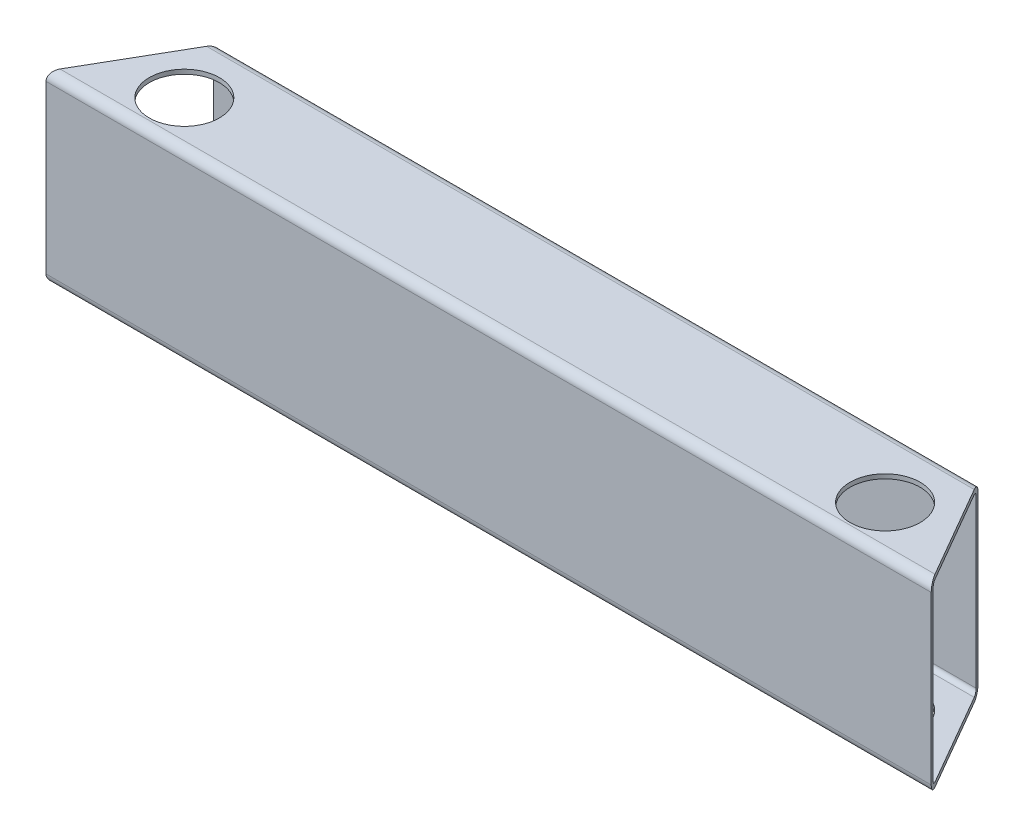
ISO-10303-21;
HEADER;
FILE_DESCRIPTION(('STEP AP214'),'2;1');
FILE_NAME('part.step','',(''),(''),'','','');
FILE_SCHEMA(('AUTOMOTIVE_DESIGN { 1 0 10303 214 1 1 1 1 }'));
ENDSEC;
DATA;
#1=APPLICATION_CONTEXT('core data for automotive mechanical design processes');
#2=APPLICATION_PROTOCOL_DEFINITION('international standard','automotive_design',2000,#1);
#3=PRODUCT_CONTEXT('',#1,'mechanical');
#4=PRODUCT('Part','Part','',(#3));
#5=PRODUCT_RELATED_PRODUCT_CATEGORY('part','',(#4));
#6=PRODUCT_DEFINITION_FORMATION('','',#4);
#7=PRODUCT_DEFINITION_CONTEXT('part definition',#1,'design');
#8=PRODUCT_DEFINITION('design','',#6,#7);
#9=PRODUCT_DEFINITION_SHAPE('','',#8);
#10=(LENGTH_UNIT() NAMED_UNIT(*) SI_UNIT(.MILLI.,.METRE.));
#11=(NAMED_UNIT(*) PLANE_ANGLE_UNIT() SI_UNIT($,.RADIAN.));
#12=(NAMED_UNIT(*) SI_UNIT($,.STERADIAN.) SOLID_ANGLE_UNIT());
#13=UNCERTAINTY_MEASURE_WITH_UNIT(LENGTH_MEASURE(1.E-05),#10,'distance_accuracy_value','');
#14=(GEOMETRIC_REPRESENTATION_CONTEXT(3) GLOBAL_UNCERTAINTY_ASSIGNED_CONTEXT((#13)) GLOBAL_UNIT_ASSIGNED_CONTEXT((#10,
#11,#12)) REPRESENTATION_CONTEXT('',''));
#15=CARTESIAN_POINT('',(0.,0.,0.));
#16=DIRECTION('',(0.,0.,1.));
#17=DIRECTION('',(1.,0.,0.));
#18=AXIS2_PLACEMENT_3D('',#15,#16,#17);
#19=CARTESIAN_POINT('',(-241.3,63.5,6.35));
#20=DIRECTION('',(0.,1.,0.));
#21=DIRECTION('',(0.,0.,1.));
#22=AXIS2_PLACEMENT_3D('',#19,#20,#21);
#23=CYLINDRICAL_SURFACE('',#22,24.13);
#24=CARTESIAN_POINT('',(-241.3,-60.452,6.35));
#25=DIRECTION('',(0.,1.,0.));
#26=DIRECTION('',(0.,0.,1.));
#27=AXIS2_PLACEMENT_3D('',#24,#25,#26);
#28=CIRCLE('',#27,24.13);
#29=CARTESIAN_POINT('',(-241.3,-60.452,30.48));
#30=VERTEX_POINT('',#29);
#31=EDGE_CURVE('E167',#30,#30,#28,.F.);
#32=ORIENTED_EDGE('',*,*,#31,.F.);
#33=EDGE_LOOP('',(#32));
#34=FACE_BOUND('',#33,.T.);
#35=CARTESIAN_POINT('',(-241.3,-63.5,6.35));
#36=DIRECTION('',(0.,1.,0.));
#37=DIRECTION('',(0.,0.,1.));
#38=AXIS2_PLACEMENT_3D('',#35,#36,#37);
#39=CIRCLE('',#38,24.13);
#40=CARTESIAN_POINT('',(-241.3,-63.5,30.48));
#41=VERTEX_POINT('',#40);
#42=EDGE_CURVE('E20',#41,#41,#39,.T.);
#43=ORIENTED_EDGE('',*,*,#42,.F.);
#44=EDGE_LOOP('',(#43));
#45=FACE_BOUND('',#44,.T.);
#46=ADVANCED_FACE('F17',(#34,#45),#23,.F.);
#47=CARTESIAN_POINT('',(241.3,63.5,6.35));
#48=DIRECTION('',(0.,1.,0.));
#49=DIRECTION('',(0.,0.,1.));
#50=AXIS2_PLACEMENT_3D('',#47,#48,#49);
#51=CYLINDRICAL_SURFACE('',#50,24.13);
#52=CARTESIAN_POINT('',(241.3,-60.452,6.35));
#53=DIRECTION('',(0.,1.,0.));
#54=DIRECTION('',(0.,0.,1.));
#55=AXIS2_PLACEMENT_3D('',#52,#53,#54);
#56=CIRCLE('',#55,24.13);
#57=CARTESIAN_POINT('',(241.3,-60.452,30.48));
#58=VERTEX_POINT('',#57);
#59=EDGE_CURVE('E163',#58,#58,#56,.F.);
#60=ORIENTED_EDGE('',*,*,#59,.F.);
#61=EDGE_LOOP('',(#60));
#62=FACE_BOUND('',#61,.T.);
#63=CARTESIAN_POINT('',(241.3,-63.5,6.35));
#64=DIRECTION('',(0.,1.,0.));
#65=DIRECTION('',(0.,0.,1.));
#66=AXIS2_PLACEMENT_3D('',#63,#64,#65);
#67=CIRCLE('',#66,24.13);
#68=CARTESIAN_POINT('',(241.3,-63.5,30.48));
#69=VERTEX_POINT('',#68);
#70=EDGE_CURVE('E175',#69,#69,#67,.T.);
#71=ORIENTED_EDGE('',*,*,#70,.F.);
#72=EDGE_LOOP('',(#71));
#73=FACE_BOUND('',#72,.T.);
#74=ADVANCED_FACE('F244',(#62,#73),#51,.F.);
#75=CARTESIAN_POINT('',(-241.3,63.5,6.35));
#76=DIRECTION('',(0.,1.,0.));
#77=DIRECTION('',(0.,0.,1.));
#78=AXIS2_PLACEMENT_3D('',#75,#76,#77);
#79=CYLINDRICAL_SURFACE('',#78,24.13);
#80=CARTESIAN_POINT('',(-241.3,60.452,6.35));
#81=DIRECTION('',(0.,1.,0.));
#82=DIRECTION('',(0.,0.,1.));
#83=AXIS2_PLACEMENT_3D('',#80,#81,#82);
#84=CIRCLE('',#83,24.13);
#85=CARTESIAN_POINT('',(-241.3,60.452,30.48));
#86=VERTEX_POINT('',#85);
#87=EDGE_CURVE('E155',#86,#86,#84,.T.);
#88=ORIENTED_EDGE('',*,*,#87,.F.);
#89=EDGE_LOOP('',(#88));
#90=FACE_BOUND('',#89,.T.);
#91=CARTESIAN_POINT('',(-241.3,63.5,6.35));
#92=DIRECTION('',(0.,1.,0.));
#93=DIRECTION('',(0.,0.,1.));
#94=AXIS2_PLACEMENT_3D('',#91,#92,#93);
#95=CIRCLE('',#94,24.13);
#96=CARTESIAN_POINT('',(-241.3,63.5,30.48));
#97=VERTEX_POINT('',#96);
#98=EDGE_CURVE('E169',#97,#97,#95,.F.);
#99=ORIENTED_EDGE('',*,*,#98,.F.);
#100=EDGE_LOOP('',(#99));
#101=FACE_BOUND('',#100,.T.);
#102=ADVANCED_FACE('F250',(#90,#101),#79,.F.);
#103=CARTESIAN_POINT('',(241.3,63.5,6.35));
#104=DIRECTION('',(0.,1.,0.));
#105=DIRECTION('',(0.,0.,1.));
#106=AXIS2_PLACEMENT_3D('',#103,#104,#105);
#107=CYLINDRICAL_SURFACE('',#106,24.13);
#108=CARTESIAN_POINT('',(241.3,60.452,6.35));
#109=DIRECTION('',(0.,1.,0.));
#110=DIRECTION('',(0.,0.,1.));
#111=AXIS2_PLACEMENT_3D('',#108,#109,#110);
#112=CIRCLE('',#111,24.13);
#113=CARTESIAN_POINT('',(241.3,60.452,30.48));
#114=VERTEX_POINT('',#113);
#115=EDGE_CURVE('E151',#114,#114,#112,.T.);
#116=ORIENTED_EDGE('',*,*,#115,.F.);
#117=EDGE_LOOP('',(#116));
#118=FACE_BOUND('',#117,.T.);
#119=CARTESIAN_POINT('',(241.3,63.5,6.35));
#120=DIRECTION('',(0.,1.,0.));
#121=DIRECTION('',(0.,0.,1.));
#122=AXIS2_PLACEMENT_3D('',#119,#120,#121);
#123=CIRCLE('',#122,24.13);
#124=CARTESIAN_POINT('',(241.3,63.5,30.48));
#125=VERTEX_POINT('',#124);
#126=EDGE_CURVE('E168',#125,#125,#123,.F.);
#127=ORIENTED_EDGE('',*,*,#126,.F.);
#128=EDGE_LOOP('',(#127));
#129=FACE_BOUND('',#128,.T.);
#130=ADVANCED_FACE('F321',(#118,#129),#107,.F.);
#131=CARTESIAN_POINT('',(-304.8,-63.5,32.004));
#132=DIRECTION('',(0.,-1.,0.));
#133=DIRECTION('',(0.,0.,-1.));
#134=AXIS2_PLACEMENT_3D('',#131,#132,#133);
#135=PLANE('',#134);
#136=ORIENTED_EDGE('',*,*,#70,.T.);
#137=EDGE_LOOP('',(#136));
#138=FACE_BOUND('',#137,.T.);
#139=ORIENTED_EDGE('',*,*,#42,.T.);
#140=EDGE_LOOP('',(#139));
#141=FACE_BOUND('',#140,.T.);
#142=DIRECTION('',(1.,0.,0.));
#143=VECTOR('',#142,1.);
#144=CARTESIAN_POINT('',(-304.8,-63.5,32.004));
#145=LINE('',#144,#143);
#146=CARTESIAN_POINT('',(-301.28047275902,-63.5,32.004));
#147=VERTEX_POINT('',#146);
#148=CARTESIAN_POINT('',(301.280472758993,-63.5,32.004));
#149=VERTEX_POINT('',#148);
#150=EDGE_CURVE('E140',#147,#149,#145,.T.);
#151=ORIENTED_EDGE('',*,*,#150,.F.);
#152=DIRECTION('',(0.500000000000017,0.,-0.866025403784429));
#153=VECTOR('',#152,1.);
#154=CARTESIAN_POINT('',(-304.8,-63.5,38.1));
#155=LINE('',#154,#153);
#156=CARTESIAN_POINT('',(-264.325436728729,-63.5,-32.004));
#157=VERTEX_POINT('',#156);
#158=EDGE_CURVE('E198',#147,#157,#155,.T.);
#159=ORIENTED_EDGE('',*,*,#158,.T.);
#160=DIRECTION('',(1.,0.,0.));
#161=VECTOR('',#160,1.);
#162=CARTESIAN_POINT('',(-304.8,-63.5,-32.004));
#163=LINE('',#162,#161);
#164=CARTESIAN_POINT('',(264.325436728702,-63.5,-32.004));
#165=VERTEX_POINT('',#164);
#166=EDGE_CURVE('E172',#165,#157,#163,.F.);
#167=ORIENTED_EDGE('',*,*,#166,.F.);
#168=DIRECTION('',(0.500000000000017,0.,0.866025403784429));
#169=VECTOR('',#168,1.);
#170=CARTESIAN_POINT('',(260.805909487722,-63.5,-38.1));
#171=LINE('',#170,#169);
#172=EDGE_CURVE('E134',#165,#149,#171,.T.);
#173=ORIENTED_EDGE('',*,*,#172,.T.);
#174=EDGE_LOOP('',(#151,#159,#167,#173));
#175=FACE_BOUND('',#174,.T.);
#176=ADVANCED_FACE('F240',(#138,#141,#175),#135,.T.);
#177=CARTESIAN_POINT('',(-304.8,-57.404,-32.004));
#178=DIRECTION('',(1.,0.,0.));
#179=DIRECTION('',(0.,0.,-1.));
#180=AXIS2_PLACEMENT_3D('',#177,#178,#179);
#181=CYLINDRICAL_SURFACE('',#180,6.096);
#182=ORIENTED_EDGE('',*,*,#166,.T.);
#183=CARTESIAN_POINT('',(-264.325436728729,-57.404,-32.004));
#184=DIRECTION('',(0.866025403784429,0.,0.500000000000017));
#185=DIRECTION('',(0.500000000000017,0.,-0.866025403784429));
#186=AXIS2_PLACEMENT_3D('',#183,#184,#185);
#187=ELLIPSE('',#186,7.03905448195999,6.096);
#188=CARTESIAN_POINT('',(-260.805909487745,-57.404,-38.1000000000029));
#189=VERTEX_POINT('',#188);
#190=EDGE_CURVE('E196',#157,#189,#187,.T.);
#191=ORIENTED_EDGE('',*,*,#190,.T.);
#192=DIRECTION('',(-1.,0.,0.));
#193=VECTOR('',#192,1.);
#194=CARTESIAN_POINT('',(-304.8,-57.404,-38.1));
#195=LINE('',#194,#193);
#196=CARTESIAN_POINT('',(260.805909487722,-57.404,-38.1));
#197=VERTEX_POINT('',#196);
#198=EDGE_CURVE('E120',#197,#189,#195,.T.);
#199=ORIENTED_EDGE('',*,*,#198,.F.);
#200=CARTESIAN_POINT('',(264.325436728702,-57.404,-32.004));
#201=DIRECTION('',(-0.866025403784429,0.,0.500000000000017));
#202=DIRECTION('',(0.500000000000017,0.,0.866025403784429));
#203=AXIS2_PLACEMENT_3D('',#200,#201,#202);
#204=ELLIPSE('',#203,7.03905448195999,6.096);
#205=EDGE_CURVE('E132',#197,#165,#204,.T.);
#206=ORIENTED_EDGE('',*,*,#205,.T.);
#207=EDGE_LOOP('',(#182,#191,#199,#206));
#208=FACE_BOUND('',#207,.T.);
#209=ADVANCED_FACE('F315',(#208),#181,.T.);
#210=CARTESIAN_POINT('',(-304.8,-57.404,-38.1));
#211=DIRECTION('',(0.,0.,-1.));
#212=DIRECTION('',(-1.,0.,0.));
#213=AXIS2_PLACEMENT_3D('',#210,#211,#212);
#214=PLANE('',#213);
#215=ORIENTED_EDGE('',*,*,#198,.T.);
#216=DIRECTION('',(0.,1.,0.));
#217=VECTOR('',#216,1.);
#218=CARTESIAN_POINT('',(-260.805909487742,63.5,-38.1000000000115));
#219=LINE('',#218,#217);
#220=CARTESIAN_POINT('',(-260.805909487745,57.404,-38.1000000000029));
#221=VERTEX_POINT('',#220);
#222=EDGE_CURVE('E118',#189,#221,#219,.T.);
#223=ORIENTED_EDGE('',*,*,#222,.T.);
#224=DIRECTION('',(1.,0.,0.));
#225=VECTOR('',#224,1.);
#226=CARTESIAN_POINT('',(-304.8,57.404,-38.1));
#227=LINE('',#226,#225);
#228=CARTESIAN_POINT('',(260.805909487722,57.404,-38.1));
#229=VERTEX_POINT('',#228);
#230=EDGE_CURVE('E111',#229,#221,#227,.F.);
#231=ORIENTED_EDGE('',*,*,#230,.F.);
#232=DIRECTION('',(0.,1.,0.));
#233=VECTOR('',#232,1.);
#234=CARTESIAN_POINT('',(260.805909487722,63.5,-38.1));
#235=LINE('',#234,#233);
#236=EDGE_CURVE('E115',#229,#197,#235,.F.);
#237=ORIENTED_EDGE('',*,*,#236,.T.);
#238=EDGE_LOOP('',(#215,#223,#231,#237));
#239=FACE_BOUND('',#238,.T.);
#240=ADVANCED_FACE('F113',(#239),#214,.T.);
#241=CARTESIAN_POINT('',(-304.8,57.404,-32.004));
#242=DIRECTION('',(1.,0.,0.));
#243=DIRECTION('',(0.,0.,-1.));
#244=AXIS2_PLACEMENT_3D('',#241,#242,#243);
#245=CYLINDRICAL_SURFACE('',#244,6.096);
#246=ORIENTED_EDGE('',*,*,#230,.T.);
#247=CARTESIAN_POINT('',(-264.325436728729,57.404,-32.004));
#248=DIRECTION('',(0.866025403784429,0.,0.500000000000017));
#249=DIRECTION('',(0.500000000000017,0.,-0.866025403784429));
#250=AXIS2_PLACEMENT_3D('',#247,#248,#249);
#251=ELLIPSE('',#250,7.03905448195999,6.096);
#252=CARTESIAN_POINT('',(-264.325436728729,63.5,-32.004));
#253=VERTEX_POINT('',#252);
#254=EDGE_CURVE('E194',#221,#253,#251,.T.);
#255=ORIENTED_EDGE('',*,*,#254,.T.);
#256=DIRECTION('',(1.,0.,0.));
#257=VECTOR('',#256,1.);
#258=CARTESIAN_POINT('',(-304.8,63.5,-32.004));
#259=LINE('',#258,#257);
#260=CARTESIAN_POINT('',(264.325436728702,63.5,-32.004));
#261=VERTEX_POINT('',#260);
#262=EDGE_CURVE('E105',#261,#253,#259,.F.);
#263=ORIENTED_EDGE('',*,*,#262,.F.);
#264=CARTESIAN_POINT('',(264.325436728702,57.404,-32.004));
#265=DIRECTION('',(-0.866025403784429,0.,0.500000000000017));
#266=DIRECTION('',(0.500000000000017,0.,0.866025403784429));
#267=AXIS2_PLACEMENT_3D('',#264,#265,#266);
#268=ELLIPSE('',#267,7.03905448195999,6.096);
#269=EDGE_CURVE('E123',#261,#229,#268,.T.);
#270=ORIENTED_EDGE('',*,*,#269,.T.);
#271=EDGE_LOOP('',(#246,#255,#263,#270));
#272=FACE_BOUND('',#271,.T.);
#273=ADVANCED_FACE('F124',(#272),#245,.T.);
#274=CARTESIAN_POINT('',(-304.8,63.5,-32.004));
#275=DIRECTION('',(0.,1.,0.));
#276=DIRECTION('',(0.,0.,1.));
#277=AXIS2_PLACEMENT_3D('',#274,#275,#276);
#278=PLANE('',#277);
#279=ORIENTED_EDGE('',*,*,#126,.T.);
#280=EDGE_LOOP('',(#279));
#281=FACE_BOUND('',#280,.T.);
#282=ORIENTED_EDGE('',*,*,#98,.T.);
#283=EDGE_LOOP('',(#282));
#284=FACE_BOUND('',#283,.T.);
#285=ORIENTED_EDGE('',*,*,#262,.T.);
#286=DIRECTION('',(0.500000000000017,0.,-0.866025403784429));
#287=VECTOR('',#286,1.);
#288=CARTESIAN_POINT('',(-304.8,63.5,38.1));
#289=LINE('',#288,#287);
#290=CARTESIAN_POINT('',(-301.28047275902,63.5,32.004));
#291=VERTEX_POINT('',#290);
#292=EDGE_CURVE('E193',#253,#291,#289,.F.);
#293=ORIENTED_EDGE('',*,*,#292,.T.);
#294=DIRECTION('',(1.,0.,0.));
#295=VECTOR('',#294,1.);
#296=CARTESIAN_POINT('',(-304.8,63.5,32.004));
#297=LINE('',#296,#295);
#298=CARTESIAN_POINT('',(301.280472758993,63.5,32.004));
#299=VERTEX_POINT('',#298);
#300=EDGE_CURVE('E202',#299,#291,#297,.F.);
#301=ORIENTED_EDGE('',*,*,#300,.F.);
#302=DIRECTION('',(0.500000000000017,0.,0.866025403784429));
#303=VECTOR('',#302,1.);
#304=CARTESIAN_POINT('',(260.805909487722,63.5,-38.1));
#305=LINE('',#304,#303);
#306=EDGE_CURVE('E126',#299,#261,#305,.F.);
#307=ORIENTED_EDGE('',*,*,#306,.T.);
#308=EDGE_LOOP('',(#285,#293,#301,#307));
#309=FACE_BOUND('',#308,.T.);
#310=ADVANCED_FACE('F306',(#281,#284,#309),#278,.T.);
#311=CARTESIAN_POINT('',(-304.8,-57.404,-32.004));
#312=DIRECTION('',(1.,0.,0.));
#313=DIRECTION('',(0.,0.,-1.));
#314=AXIS2_PLACEMENT_3D('',#311,#312,#313);
#315=CYLINDRICAL_SURFACE('',#314,3.048);
#316=CARTESIAN_POINT('',(264.325436728702,-57.404,-32.004));
#317=DIRECTION('',(-0.866025403784429,0.,0.500000000000017));
#318=DIRECTION('',(0.500000000000017,0.,0.866025403784429));
#319=AXIS2_PLACEMENT_3D('',#316,#317,#318);
#320=ELLIPSE('',#319,3.51952724098,3.048);
#321=CARTESIAN_POINT('',(264.325436728702,-60.452,-32.004));
#322=VERTEX_POINT('',#321);
#323=CARTESIAN_POINT('',(262.565673108203,-57.404,-35.0520000000076));
#324=VERTEX_POINT('',#323);
#325=EDGE_CURVE('E219',#322,#324,#320,.F.);
#326=ORIENTED_EDGE('',*,*,#325,.T.);
#327=DIRECTION('',(1.,0.,0.));
#328=VECTOR('',#327,1.);
#329=CARTESIAN_POINT('',(-304.8,-57.404,-35.052));
#330=LINE('',#329,#328);
#331=CARTESIAN_POINT('',(-262.565673108227,-57.404,-35.0520000000105));
#332=VERTEX_POINT('',#331);
#333=EDGE_CURVE('E146',#332,#324,#330,.T.);
#334=ORIENTED_EDGE('',*,*,#333,.F.);
#335=CARTESIAN_POINT('',(-264.325436728729,-57.404,-32.004));
#336=DIRECTION('',(0.866025403784429,0.,0.500000000000017));
#337=DIRECTION('',(0.500000000000017,0.,-0.866025403784429));
#338=AXIS2_PLACEMENT_3D('',#335,#336,#337);
#339=ELLIPSE('',#338,3.51952724098,3.048);
#340=CARTESIAN_POINT('',(-264.325436728729,-60.452,-32.004));
#341=VERTEX_POINT('',#340);
#342=EDGE_CURVE('E189',#332,#341,#339,.F.);
#343=ORIENTED_EDGE('',*,*,#342,.T.);
#344=DIRECTION('',(1.,0.,0.));
#345=VECTOR('',#344,1.);
#346=CARTESIAN_POINT('',(-304.8,-60.452,-32.004));
#347=LINE('',#346,#345);
#348=EDGE_CURVE('E164',#322,#341,#347,.F.);
#349=ORIENTED_EDGE('',*,*,#348,.F.);
#350=EDGE_LOOP('',(#326,#334,#343,#349));
#351=FACE_BOUND('',#350,.T.);
#352=ADVANCED_FACE('F302',(#351),#315,.F.);
#353=CARTESIAN_POINT('',(-304.8,-60.452,-32.004));
#354=DIRECTION('',(0.,1.,0.));
#355=DIRECTION('',(0.,0.,1.));
#356=AXIS2_PLACEMENT_3D('',#353,#354,#355);
#357=PLANE('',#356);
#358=ORIENTED_EDGE('',*,*,#59,.T.);
#359=EDGE_LOOP('',(#358));
#360=FACE_BOUND('',#359,.T.);
#361=ORIENTED_EDGE('',*,*,#31,.T.);
#362=EDGE_LOOP('',(#361));
#363=FACE_BOUND('',#362,.T.);
#364=ORIENTED_EDGE('',*,*,#348,.T.);
#365=DIRECTION('',(0.500000000000017,0.,-0.866025403784429));
#366=VECTOR('',#365,1.);
#367=CARTESIAN_POINT('',(-304.8,-60.452,38.1));
#368=LINE('',#367,#366);
#369=CARTESIAN_POINT('',(-301.28047275902,-60.452,32.004));
#370=VERTEX_POINT('',#369);
#371=EDGE_CURVE('E188',#341,#370,#368,.F.);
#372=ORIENTED_EDGE('',*,*,#371,.T.);
#373=DIRECTION('',(1.,0.,0.));
#374=VECTOR('',#373,1.);
#375=CARTESIAN_POINT('',(-304.8,-60.452,32.004));
#376=LINE('',#375,#374);
#377=CARTESIAN_POINT('',(301.280472758993,-60.452,32.004));
#378=VERTEX_POINT('',#377);
#379=EDGE_CURVE('E161',#370,#378,#376,.T.);
#380=ORIENTED_EDGE('',*,*,#379,.T.);
#381=DIRECTION('',(0.500000000000017,0.,0.866025403784429));
#382=VECTOR('',#381,1.);
#383=CARTESIAN_POINT('',(260.805909487722,-60.452,-38.1));
#384=LINE('',#383,#382);
#385=EDGE_CURVE('E206',#378,#322,#384,.F.);
#386=ORIENTED_EDGE('',*,*,#385,.T.);
#387=EDGE_LOOP('',(#364,#372,#380,#386));
#388=FACE_BOUND('',#387,.T.);
#389=ADVANCED_FACE('F298',(#360,#363,#388),#357,.T.);
#390=CARTESIAN_POINT('',(-304.8,-57.404,32.004));
#391=DIRECTION('',(1.,0.,0.));
#392=DIRECTION('',(0.,0.,-1.));
#393=AXIS2_PLACEMENT_3D('',#390,#391,#392);
#394=CYLINDRICAL_SURFACE('',#393,3.048);
#395=CARTESIAN_POINT('',(301.280472758993,-57.404,32.004));
#396=DIRECTION('',(-0.866025403784429,0.,0.500000000000017));
#397=DIRECTION('',(0.500000000000017,0.,0.866025403784429));
#398=AXIS2_PLACEMENT_3D('',#395,#396,#397);
#399=ELLIPSE('',#398,3.51952724098,3.048);
#400=CARTESIAN_POINT('',(303.040236379495,-57.404,35.0520000000105));
#401=VERTEX_POINT('',#400);
#402=EDGE_CURVE('E207',#401,#378,#399,.F.);
#403=ORIENTED_EDGE('',*,*,#402,.T.);
#404=ORIENTED_EDGE('',*,*,#379,.F.);
#405=CARTESIAN_POINT('',(-301.28047275902,-57.404,32.004));
#406=DIRECTION('',(0.866025403784429,0.,0.500000000000017));
#407=DIRECTION('',(0.500000000000017,0.,-0.866025403784429));
#408=AXIS2_PLACEMENT_3D('',#405,#406,#407);
#409=ELLIPSE('',#408,3.51952724098,3.048);
#410=CARTESIAN_POINT('',(-303.040236379519,-57.404,35.0520000000076));
#411=VERTEX_POINT('',#410);
#412=EDGE_CURVE('E185',#370,#411,#409,.F.);
#413=ORIENTED_EDGE('',*,*,#412,.T.);
#414=DIRECTION('',(-1.,0.,0.));
#415=VECTOR('',#414,1.);
#416=CARTESIAN_POINT('',(-304.8,-57.404,35.052));
#417=LINE('',#416,#415);
#418=EDGE_CURVE('E158',#401,#411,#417,.T.);
#419=ORIENTED_EDGE('',*,*,#418,.F.);
#420=EDGE_LOOP('',(#403,#404,#413,#419));
#421=FACE_BOUND('',#420,.T.);
#422=ADVANCED_FACE('F294',(#421),#394,.F.);
#423=CARTESIAN_POINT('',(-304.8,-57.404,35.052));
#424=DIRECTION('',(0.,0.,-1.));
#425=DIRECTION('',(-1.,0.,0.));
#426=AXIS2_PLACEMENT_3D('',#423,#424,#425);
#427=PLANE('',#426);
#428=ORIENTED_EDGE('',*,*,#418,.T.);
#429=DIRECTION('',(0.,1.,0.));
#430=VECTOR('',#429,1.);
#431=CARTESIAN_POINT('',(-303.040236379527,63.5,35.0520000000303));
#432=LINE('',#431,#430);
#433=CARTESIAN_POINT('',(-303.040236379519,57.404,35.0520000000076));
#434=VERTEX_POINT('',#433);
#435=EDGE_CURVE('E184',#411,#434,#432,.T.);
#436=ORIENTED_EDGE('',*,*,#435,.T.);
#437=DIRECTION('',(1.,0.,0.));
#438=VECTOR('',#437,1.);
#439=CARTESIAN_POINT('',(-304.8,57.404,35.052));
#440=LINE('',#439,#438);
#441=CARTESIAN_POINT('',(303.040236379495,57.404,35.0520000000105));
#442=VERTEX_POINT('',#441);
#443=EDGE_CURVE('E156',#434,#442,#440,.T.);
#444=ORIENTED_EDGE('',*,*,#443,.T.);
#445=DIRECTION('',(0.,1.,0.));
#446=VECTOR('',#445,1.);
#447=CARTESIAN_POINT('',(303.040236379508,63.5,35.0520000000418));
#448=LINE('',#447,#446);
#449=EDGE_CURVE('E210',#442,#401,#448,.F.);
#450=ORIENTED_EDGE('',*,*,#449,.T.);
#451=EDGE_LOOP('',(#428,#436,#444,#450));
#452=FACE_BOUND('',#451,.T.);
#453=ADVANCED_FACE('F290',(#452),#427,.T.);
#454=CARTESIAN_POINT('',(-304.8,57.404,32.004));
#455=DIRECTION('',(1.,0.,0.));
#456=DIRECTION('',(0.,0.,-1.));
#457=AXIS2_PLACEMENT_3D('',#454,#455,#456);
#458=CYLINDRICAL_SURFACE('',#457,3.048);
#459=CARTESIAN_POINT('',(301.280472758993,57.404,32.004));
#460=DIRECTION('',(-0.866025403784429,0.,0.500000000000017));
#461=DIRECTION('',(0.500000000000017,0.,0.866025403784429));
#462=AXIS2_PLACEMENT_3D('',#459,#460,#461);
#463=ELLIPSE('',#462,3.51952724098,3.048);
#464=CARTESIAN_POINT('',(301.280472758993,60.452,32.004));
#465=VERTEX_POINT('',#464);
#466=EDGE_CURVE('E211',#465,#442,#463,.F.);
#467=ORIENTED_EDGE('',*,*,#466,.T.);
#468=ORIENTED_EDGE('',*,*,#443,.F.);
#469=CARTESIAN_POINT('',(-301.28047275902,57.404,32.004));
#470=DIRECTION('',(0.866025403784429,0.,0.500000000000017));
#471=DIRECTION('',(0.500000000000017,0.,-0.866025403784429));
#472=AXIS2_PLACEMENT_3D('',#469,#470,#471);
#473=ELLIPSE('',#472,3.51952724098,3.048);
#474=CARTESIAN_POINT('',(-301.28047275902,60.452,32.004));
#475=VERTEX_POINT('',#474);
#476=EDGE_CURVE('E181',#434,#475,#473,.F.);
#477=ORIENTED_EDGE('',*,*,#476,.T.);
#478=DIRECTION('',(1.,0.,0.));
#479=VECTOR('',#478,1.);
#480=CARTESIAN_POINT('',(-304.8,60.452,32.004));
#481=LINE('',#480,#479);
#482=EDGE_CURVE('E152',#465,#475,#481,.F.);
#483=ORIENTED_EDGE('',*,*,#482,.F.);
#484=EDGE_LOOP('',(#467,#468,#477,#483));
#485=FACE_BOUND('',#484,.T.);
#486=ADVANCED_FACE('F286',(#485),#458,.F.);
#487=CARTESIAN_POINT('',(-304.8,60.452,32.004));
#488=DIRECTION('',(0.,-1.,0.));
#489=DIRECTION('',(0.,0.,-1.));
#490=AXIS2_PLACEMENT_3D('',#487,#488,#489);
#491=PLANE('',#490);
#492=ORIENTED_EDGE('',*,*,#115,.T.);
#493=EDGE_LOOP('',(#492));
#494=FACE_BOUND('',#493,.T.);
#495=ORIENTED_EDGE('',*,*,#87,.T.);
#496=EDGE_LOOP('',(#495));
#497=FACE_BOUND('',#496,.T.);
#498=ORIENTED_EDGE('',*,*,#482,.T.);
#499=DIRECTION('',(0.500000000000017,0.,-0.866025403784429));
#500=VECTOR('',#499,1.);
#501=CARTESIAN_POINT('',(-304.8,60.452,38.1));
#502=LINE('',#501,#500);
#503=CARTESIAN_POINT('',(-264.325436728729,60.452,-32.004));
#504=VERTEX_POINT('',#503);
#505=EDGE_CURVE('E180',#475,#504,#502,.T.);
#506=ORIENTED_EDGE('',*,*,#505,.T.);
#507=DIRECTION('',(1.,0.,0.));
#508=VECTOR('',#507,1.);
#509=CARTESIAN_POINT('',(-304.8,60.452,-32.004));
#510=LINE('',#509,#508);
#511=CARTESIAN_POINT('',(264.325436728702,60.452,-32.004));
#512=VERTEX_POINT('',#511);
#513=EDGE_CURVE('E149',#504,#512,#510,.T.);
#514=ORIENTED_EDGE('',*,*,#513,.T.);
#515=DIRECTION('',(0.500000000000017,0.,0.866025403784429));
#516=VECTOR('',#515,1.);
#517=CARTESIAN_POINT('',(260.805909487722,60.452,-38.1));
#518=LINE('',#517,#516);
#519=EDGE_CURVE('E214',#512,#465,#518,.T.);
#520=ORIENTED_EDGE('',*,*,#519,.T.);
#521=EDGE_LOOP('',(#498,#506,#514,#520));
#522=FACE_BOUND('',#521,.T.);
#523=ADVANCED_FACE('F282',(#494,#497,#522),#491,.T.);
#524=CARTESIAN_POINT('',(-304.8,57.404,-32.004));
#525=DIRECTION('',(1.,0.,0.));
#526=DIRECTION('',(0.,0.,-1.));
#527=AXIS2_PLACEMENT_3D('',#524,#525,#526);
#528=CYLINDRICAL_SURFACE('',#527,3.048);
#529=CARTESIAN_POINT('',(264.325436728702,57.404,-32.004));
#530=DIRECTION('',(-0.866025403784429,0.,0.500000000000017));
#531=DIRECTION('',(0.500000000000017,0.,0.866025403784429));
#532=AXIS2_PLACEMENT_3D('',#529,#530,#531);
#533=ELLIPSE('',#532,3.51952724098,3.048);
#534=CARTESIAN_POINT('',(262.565673108203,57.404,-35.0520000000076));
#535=VERTEX_POINT('',#534);
#536=EDGE_CURVE('E215',#535,#512,#533,.F.);
#537=ORIENTED_EDGE('',*,*,#536,.T.);
#538=ORIENTED_EDGE('',*,*,#513,.F.);
#539=CARTESIAN_POINT('',(-264.325436728729,57.404,-32.004));
#540=DIRECTION('',(0.866025403784429,0.,0.500000000000017));
#541=DIRECTION('',(0.500000000000017,0.,-0.866025403784429));
#542=AXIS2_PLACEMENT_3D('',#539,#540,#541);
#543=ELLIPSE('',#542,3.51952724098,3.048);
#544=CARTESIAN_POINT('',(-262.565673108227,57.404,-35.0520000000105));
#545=VERTEX_POINT('',#544);
#546=EDGE_CURVE('E176',#504,#545,#543,.F.);
#547=ORIENTED_EDGE('',*,*,#546,.T.);
#548=DIRECTION('',(1.,0.,0.));
#549=VECTOR('',#548,1.);
#550=CARTESIAN_POINT('',(-304.8,57.404,-35.052));
#551=LINE('',#550,#549);
#552=EDGE_CURVE('E143',#535,#545,#551,.F.);
#553=ORIENTED_EDGE('',*,*,#552,.F.);
#554=EDGE_LOOP('',(#537,#538,#547,#553));
#555=FACE_BOUND('',#554,.T.);
#556=ADVANCED_FACE('F278',(#555),#528,.F.);
#557=CARTESIAN_POINT('',(-304.8,57.404,-35.052));
#558=DIRECTION('',(0.,0.,1.));
#559=DIRECTION('',(1.,0.,0.));
#560=AXIS2_PLACEMENT_3D('',#557,#558,#559);
#561=PLANE('',#560);
#562=ORIENTED_EDGE('',*,*,#552,.T.);
#563=DIRECTION('',(0.,1.,0.));
#564=VECTOR('',#563,1.);
#565=CARTESIAN_POINT('',(-262.565673108214,63.5,-35.0520000000418));
#566=LINE('',#565,#564);
#567=EDGE_CURVE('E179',#545,#332,#566,.F.);
#568=ORIENTED_EDGE('',*,*,#567,.T.);
#569=ORIENTED_EDGE('',*,*,#333,.T.);
#570=DIRECTION('',(0.,1.,0.));
#571=VECTOR('',#570,1.);
#572=CARTESIAN_POINT('',(262.565673108195,63.5,-35.0520000000304));
#573=LINE('',#572,#571);
#574=EDGE_CURVE('E218',#324,#535,#573,.T.);
#575=ORIENTED_EDGE('',*,*,#574,.T.);
#576=EDGE_LOOP('',(#562,#568,#569,#575));
#577=FACE_BOUND('',#576,.T.);
#578=ADVANCED_FACE('F274',(#577),#561,.T.);
#579=CARTESIAN_POINT('',(-304.8,-57.404,32.004));
#580=DIRECTION('',(1.,0.,0.));
#581=DIRECTION('',(0.,0.,-1.));
#582=AXIS2_PLACEMENT_3D('',#579,#580,#581);
#583=CYLINDRICAL_SURFACE('',#582,6.096);
#584=DIRECTION('',(1.,0.,0.));
#585=VECTOR('',#584,1.);
#586=CARTESIAN_POINT('',(-304.8,-57.404,38.1));
#587=LINE('',#586,#585);
#588=CARTESIAN_POINT('',(-304.8,-57.404,38.1));
#589=VERTEX_POINT('',#588);
#590=CARTESIAN_POINT('',(304.799999999987,-57.404,38.1));
#591=VERTEX_POINT('',#590);
#592=EDGE_CURVE('E346',#589,#591,#587,.T.);
#593=ORIENTED_EDGE('',*,*,#592,.F.);
#594=CARTESIAN_POINT('',(-301.28047275902,-57.404,32.004));
#595=DIRECTION('',(0.866025403784429,0.,0.500000000000017));
#596=DIRECTION('',(0.500000000000017,0.,-0.866025403784429));
#597=AXIS2_PLACEMENT_3D('',#594,#595,#596);
#598=ELLIPSE('',#597,7.03905448195999,6.096);
#599=EDGE_CURVE('E199',#589,#147,#598,.T.);
#600=ORIENTED_EDGE('',*,*,#599,.T.);
#601=ORIENTED_EDGE('',*,*,#150,.T.);
#602=CARTESIAN_POINT('',(301.280472758993,-57.404,32.004));
#603=DIRECTION('',(-0.866025403784429,0.,0.500000000000017));
#604=DIRECTION('',(0.500000000000017,0.,0.866025403784429));
#605=AXIS2_PLACEMENT_3D('',#602,#603,#604);
#606=ELLIPSE('',#605,7.03905448195999,6.096);
#607=EDGE_CURVE('E221',#149,#591,#606,.T.);
#608=ORIENTED_EDGE('',*,*,#607,.T.);
#609=EDGE_LOOP('',(#593,#600,#601,#608));
#610=FACE_BOUND('',#609,.T.);
#611=ADVANCED_FACE('F270',(#610),#583,.T.);
#612=CARTESIAN_POINT('',(260.805909487722,63.5,-38.1));
#613=DIRECTION('',(-0.866025403784429,0.,0.500000000000017));
#614=DIRECTION('',(0.500000000000017,0.,0.866025403784429));
#615=AXIS2_PLACEMENT_3D('',#612,#613,#614);
#616=PLANE('',#615);
#617=ORIENTED_EDGE('',*,*,#402,.F.);
#618=ORIENTED_EDGE('',*,*,#449,.F.);
#619=ORIENTED_EDGE('',*,*,#466,.F.);
#620=ORIENTED_EDGE('',*,*,#519,.F.);
#621=ORIENTED_EDGE('',*,*,#536,.F.);
#622=ORIENTED_EDGE('',*,*,#574,.F.);
#623=ORIENTED_EDGE('',*,*,#325,.F.);
#624=ORIENTED_EDGE('',*,*,#385,.F.);
#625=EDGE_LOOP('',(#617,#618,#619,#620,#621,#622,#623,#624));
#626=FACE_BOUND('',#625,.T.);
#627=ORIENTED_EDGE('',*,*,#607,.F.);
#628=ORIENTED_EDGE('',*,*,#172,.F.);
#629=ORIENTED_EDGE('',*,*,#205,.F.);
#630=ORIENTED_EDGE('',*,*,#236,.F.);
#631=ORIENTED_EDGE('',*,*,#269,.F.);
#632=ORIENTED_EDGE('',*,*,#306,.F.);
#633=CARTESIAN_POINT('',(301.280472758993,57.404,32.004));
#634=DIRECTION('',(-0.866025403784429,0.,0.500000000000017));
#635=DIRECTION('',(0.500000000000017,0.,0.866025403784429));
#636=AXIS2_PLACEMENT_3D('',#633,#634,#635);
#637=ELLIPSE('',#636,7.03905448195999,6.096);
#638=CARTESIAN_POINT('',(304.799999999987,57.404,38.1));
#639=VERTEX_POINT('',#638);
#640=EDGE_CURVE('E203',#639,#299,#637,.T.);
#641=ORIENTED_EDGE('',*,*,#640,.F.);
#642=DIRECTION('',(0.,1.,0.));
#643=VECTOR('',#642,1.);
#644=CARTESIAN_POINT('',(304.8,57.404,38.1));
#645=LINE('',#644,#643);
#646=EDGE_CURVE('E344',#591,#639,#645,.T.);
#647=ORIENTED_EDGE('',*,*,#646,.F.);
#648=EDGE_LOOP('',(#627,#628,#629,#630,#631,#632,#641,#647));
#649=FACE_BOUND('',#648,.T.);
#650=ADVANCED_FACE('F129',(#626,#649),#616,.F.);
#651=CARTESIAN_POINT('',(-304.8,57.404,32.004));
#652=DIRECTION('',(1.,0.,0.));
#653=DIRECTION('',(0.,0.,-1.));
#654=AXIS2_PLACEMENT_3D('',#651,#652,#653);
#655=CYLINDRICAL_SURFACE('',#654,6.096);
#656=ORIENTED_EDGE('',*,*,#300,.T.);
#657=CARTESIAN_POINT('',(-301.28047275902,57.404,32.004));
#658=DIRECTION('',(0.866025403784429,0.,0.500000000000017));
#659=DIRECTION('',(0.500000000000017,0.,-0.866025403784429));
#660=AXIS2_PLACEMENT_3D('',#657,#658,#659);
#661=ELLIPSE('',#660,7.03905448195999,6.096);
#662=CARTESIAN_POINT('',(-304.8,57.404,38.1));
#663=VERTEX_POINT('',#662);
#664=EDGE_CURVE('E35',#291,#663,#661,.T.);
#665=ORIENTED_EDGE('',*,*,#664,.T.);
#666=DIRECTION('',(1.,0.,0.));
#667=VECTOR('',#666,1.);
#668=CARTESIAN_POINT('',(-304.8,57.404,38.1));
#669=LINE('',#668,#667);
#670=EDGE_CURVE('E26',#639,#663,#669,.F.);
#671=ORIENTED_EDGE('',*,*,#670,.F.);
#672=ORIENTED_EDGE('',*,*,#640,.T.);
#673=EDGE_LOOP('',(#656,#665,#671,#672));
#674=FACE_BOUND('',#673,.T.);
#675=ADVANCED_FACE('F261',(#674),#655,.T.);
#676=CARTESIAN_POINT('',(-304.8,63.5,38.1));
#677=DIRECTION('',(0.866025403784429,0.,0.500000000000017));
#678=DIRECTION('',(0.500000000000017,0.,-0.866025403784429));
#679=AXIS2_PLACEMENT_3D('',#676,#677,#678);
#680=PLANE('',#679);
#681=ORIENTED_EDGE('',*,*,#546,.F.);
#682=ORIENTED_EDGE('',*,*,#505,.F.);
#683=ORIENTED_EDGE('',*,*,#476,.F.);
#684=ORIENTED_EDGE('',*,*,#435,.F.);
#685=ORIENTED_EDGE('',*,*,#412,.F.);
#686=ORIENTED_EDGE('',*,*,#371,.F.);
#687=ORIENTED_EDGE('',*,*,#342,.F.);
#688=ORIENTED_EDGE('',*,*,#567,.F.);
#689=EDGE_LOOP('',(#681,#682,#683,#684,#685,#686,#687,#688));
#690=FACE_BOUND('',#689,.T.);
#691=ORIENTED_EDGE('',*,*,#664,.F.);
#692=ORIENTED_EDGE('',*,*,#292,.F.);
#693=ORIENTED_EDGE('',*,*,#254,.F.);
#694=ORIENTED_EDGE('',*,*,#222,.F.);
#695=ORIENTED_EDGE('',*,*,#190,.F.);
#696=ORIENTED_EDGE('',*,*,#158,.F.);
#697=ORIENTED_EDGE('',*,*,#599,.F.);
#698=DIRECTION('',(0.,1.,0.));
#699=VECTOR('',#698,1.);
#700=CARTESIAN_POINT('',(-304.8,57.404,38.1));
#701=LINE('',#700,#699);
#702=EDGE_CURVE('E11',#663,#589,#701,.F.);
#703=ORIENTED_EDGE('',*,*,#702,.F.);
#704=EDGE_LOOP('',(#691,#692,#693,#694,#695,#696,#697,#703));
#705=FACE_BOUND('',#704,.T.);
#706=ADVANCED_FACE('F255',(#690,#705),#680,.F.);
#707=CARTESIAN_POINT('',(-304.8,57.404,38.1));
#708=DIRECTION('',(0.,0.,1.));
#709=DIRECTION('',(1.,0.,0.));
#710=AXIS2_PLACEMENT_3D('',#707,#708,#709);
#711=PLANE('',#710);
#712=ORIENTED_EDGE('',*,*,#670,.T.);
#713=ORIENTED_EDGE('',*,*,#702,.T.);
#714=ORIENTED_EDGE('',*,*,#592,.T.);
#715=ORIENTED_EDGE('',*,*,#646,.T.);
#716=EDGE_LOOP('',(#712,#713,#714,#715));
#717=FACE_BOUND('',#716,.T.);
#718=ADVANCED_FACE('F253',(#717),#711,.T.);
#719=CLOSED_SHELL('',(#46,#74,#102,#130,#176,#209,#240,#273,#310,#352,#389,#422,#453,#486,#523,
#556,#578,#611,#650,#675,#706,#718));
#720=MANIFOLD_SOLID_BREP('B1',#719);
#721=ADVANCED_BREP_SHAPE_REPRESENTATION('',(#18,#720),#14);
#722=SHAPE_DEFINITION_REPRESENTATION(#9,#721);
ENDSEC;
END-ISO-10303-21;
